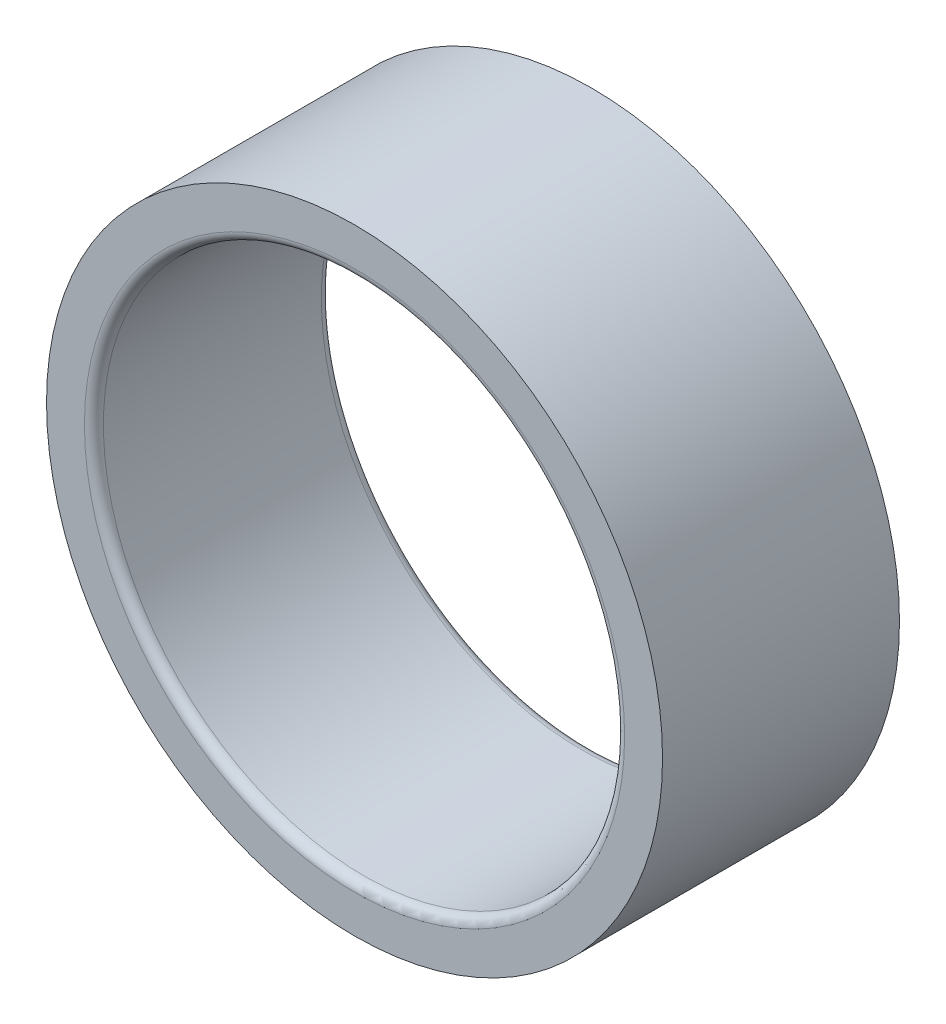
ISO-10303-21;
HEADER;
FILE_DESCRIPTION(('STEP AP214'),'2;1');
FILE_NAME('part.step','',(''),(''),'','','');
FILE_SCHEMA(('AUTOMOTIVE_DESIGN { 1 0 10303 214 1 1 1 1 }'));
ENDSEC;
DATA;
#1=APPLICATION_CONTEXT('core data for automotive mechanical design processes');
#2=APPLICATION_PROTOCOL_DEFINITION('international standard','automotive_design',2000,#1);
#3=PRODUCT_CONTEXT('',#1,'mechanical');
#4=PRODUCT('Part','Part','',(#3));
#5=PRODUCT_RELATED_PRODUCT_CATEGORY('part','',(#4));
#6=PRODUCT_DEFINITION_FORMATION('','',#4);
#7=PRODUCT_DEFINITION_CONTEXT('part definition',#1,'design');
#8=PRODUCT_DEFINITION('design','',#6,#7);
#9=PRODUCT_DEFINITION_SHAPE('','',#8);
#10=(LENGTH_UNIT() NAMED_UNIT(*) SI_UNIT(.MILLI.,.METRE.));
#11=(NAMED_UNIT(*) PLANE_ANGLE_UNIT() SI_UNIT($,.RADIAN.));
#12=(NAMED_UNIT(*) SI_UNIT($,.STERADIAN.) SOLID_ANGLE_UNIT());
#13=UNCERTAINTY_MEASURE_WITH_UNIT(LENGTH_MEASURE(1.E-05),#10,'distance_accuracy_value','');
#14=(GEOMETRIC_REPRESENTATION_CONTEXT(3) GLOBAL_UNCERTAINTY_ASSIGNED_CONTEXT((#13)) GLOBAL_UNIT_ASSIGNED_CONTEXT((#10,
#11,#12)) REPRESENTATION_CONTEXT('',''));
#15=CARTESIAN_POINT('',(0.,0.,0.));
#16=DIRECTION('',(0.,0.,1.));
#17=DIRECTION('',(1.,0.,0.));
#18=AXIS2_PLACEMENT_3D('',#15,#16,#17);
#19=CARTESIAN_POINT('',(0.,0.,50.));
#20=DIRECTION('',(0.,0.,-1.));
#21=DIRECTION('',(-1.,0.,0.));
#22=AXIS2_PLACEMENT_3D('',#19,#20,#21);
#23=CYLINDRICAL_SURFACE('',#22,65.);
#24=CARTESIAN_POINT('',(0.,0.,50.));
#25=DIRECTION('',(0.,0.,1.));
#26=DIRECTION('',(1.,0.,0.));
#27=AXIS2_PLACEMENT_3D('',#24,#25,#26);
#28=CIRCLE('',#27,65.);
#29=CARTESIAN_POINT('',(65.,0.,50.));
#30=VERTEX_POINT('',#29);
#31=EDGE_CURVE('E50',#30,#30,#28,.T.);
#32=ORIENTED_EDGE('',*,*,#31,.F.);
#33=EDGE_LOOP('',(#32));
#34=FACE_BOUND('',#33,.T.);
#35=CARTESIAN_POINT('',(0.,0.,0.));
#36=DIRECTION('',(0.,0.,1.));
#37=DIRECTION('',(1.,0.,0.));
#38=AXIS2_PLACEMENT_3D('',#35,#36,#37);
#39=CIRCLE('',#38,65.);
#40=CARTESIAN_POINT('',(65.,0.,0.));
#41=VERTEX_POINT('',#40);
#42=EDGE_CURVE('E51',#41,#41,#39,.T.);
#43=ORIENTED_EDGE('',*,*,#42,.T.);
#44=EDGE_LOOP('',(#43));
#45=FACE_BOUND('',#44,.T.);
#46=ADVANCED_FACE('F30',(#34,#45),#23,.T.);
#47=CARTESIAN_POINT('',(0.,0.,50.));
#48=DIRECTION('',(0.,0.,1.));
#49=DIRECTION('',(1.,0.,0.));
#50=AXIS2_PLACEMENT_3D('',#47,#48,#49);
#51=PLANE('',#50);
#52=CARTESIAN_POINT('',(0.,0.,50.));
#53=DIRECTION('',(0.,0.,1.));
#54=DIRECTION('',(1.,0.,0.));
#55=AXIS2_PLACEMENT_3D('',#52,#53,#54);
#56=CIRCLE('',#55,57.);
#57=CARTESIAN_POINT('',(57.,0.,50.));
#58=VERTEX_POINT('',#57);
#59=EDGE_CURVE('E10',#58,#58,#56,.F.);
#60=ORIENTED_EDGE('',*,*,#59,.T.);
#61=EDGE_LOOP('',(#60));
#62=FACE_BOUND('',#61,.T.);
#63=ORIENTED_EDGE('',*,*,#31,.T.);
#64=EDGE_LOOP('',(#63));
#65=FACE_BOUND('',#64,.T.);
#66=ADVANCED_FACE('F57',(#62,#65),#51,.T.);
#67=CARTESIAN_POINT('',(0.,0.,0.));
#68=DIRECTION('',(0.,0.,1.));
#69=DIRECTION('',(1.,0.,0.));
#70=AXIS2_PLACEMENT_3D('',#67,#68,#69);
#71=PLANE('',#70);
#72=CARTESIAN_POINT('',(0.,0.,0.));
#73=DIRECTION('',(0.,0.,1.));
#74=DIRECTION('',(1.,0.,0.));
#75=AXIS2_PLACEMENT_3D('',#72,#73,#74);
#76=CIRCLE('',#75,57.);
#77=CARTESIAN_POINT('',(57.,0.,0.));
#78=VERTEX_POINT('',#77);
#79=EDGE_CURVE('E45',#78,#78,#76,.T.);
#80=ORIENTED_EDGE('',*,*,#79,.T.);
#81=EDGE_LOOP('',(#80));
#82=FACE_BOUND('',#81,.T.);
#83=ORIENTED_EDGE('',*,*,#42,.F.);
#84=EDGE_LOOP('',(#83));
#85=FACE_BOUND('',#84,.T.);
#86=ADVANCED_FACE('F64',(#82,#85),#71,.F.);
#87=CARTESIAN_POINT('',(0.,0.,0.));
#88=DIRECTION('',(0.,0.,1.));
#89=DIRECTION('',(1.,0.,0.));
#90=AXIS2_PLACEMENT_3D('',#87,#88,#89);
#91=CYLINDRICAL_SURFACE('',#90,55.);
#92=CARTESIAN_POINT('',(0.,0.,2.));
#93=DIRECTION('',(0.,0.,1.));
#94=DIRECTION('',(1.,0.,0.));
#95=AXIS2_PLACEMENT_3D('',#92,#93,#94);
#96=CIRCLE('',#95,55.);
#97=CARTESIAN_POINT('',(55.,0.,2.));
#98=VERTEX_POINT('',#97);
#99=EDGE_CURVE('E37',#98,#98,#96,.F.);
#100=ORIENTED_EDGE('',*,*,#99,.T.);
#101=EDGE_LOOP('',(#100));
#102=FACE_BOUND('',#101,.T.);
#103=CARTESIAN_POINT('',(0.,0.,48.));
#104=DIRECTION('',(0.,0.,1.));
#105=DIRECTION('',(1.,0.,0.));
#106=AXIS2_PLACEMENT_3D('',#103,#104,#105);
#107=CIRCLE('',#106,55.);
#108=CARTESIAN_POINT('',(55.,0.,48.));
#109=VERTEX_POINT('',#108);
#110=EDGE_CURVE('E41',#109,#109,#107,.T.);
#111=ORIENTED_EDGE('',*,*,#110,.T.);
#112=EDGE_LOOP('',(#111));
#113=FACE_BOUND('',#112,.T.);
#114=ADVANCED_FACE('F66',(#102,#113),#91,.F.);
#115=CARTESIAN_POINT('',(0.,0.,2.));
#116=DIRECTION('',(0.,0.,1.));
#117=DIRECTION('',(1.,0.,0.));
#118=AXIS2_PLACEMENT_3D('',#115,#116,#117);
#119=TOROIDAL_SURFACE('',#118,57.,2.);
#120=ORIENTED_EDGE('',*,*,#99,.F.);
#121=EDGE_LOOP('',(#120));
#122=FACE_BOUND('',#121,.T.);
#123=ORIENTED_EDGE('',*,*,#79,.F.);
#124=EDGE_LOOP('',(#123));
#125=FACE_BOUND('',#124,.T.);
#126=ADVANCED_FACE('F73',(#122,#125),#119,.T.);
#127=CARTESIAN_POINT('',(0.,0.,48.));
#128=DIRECTION('',(0.,0.,1.));
#129=DIRECTION('',(1.,0.,0.));
#130=AXIS2_PLACEMENT_3D('',#127,#128,#129);
#131=TOROIDAL_SURFACE('',#130,57.,2.);
#132=ORIENTED_EDGE('',*,*,#59,.F.);
#133=EDGE_LOOP('',(#132));
#134=FACE_BOUND('',#133,.T.);
#135=ORIENTED_EDGE('',*,*,#110,.F.);
#136=EDGE_LOOP('',(#135));
#137=FACE_BOUND('',#136,.T.);
#138=ADVANCED_FACE('F32',(#134,#137),#131,.T.);
#139=CLOSED_SHELL('',(#46,#66,#86,#114,#126,#138));
#140=MANIFOLD_SOLID_BREP('B2',#139);
#141=ADVANCED_BREP_SHAPE_REPRESENTATION('',(#18,#140),#14);
#142=SHAPE_DEFINITION_REPRESENTATION(#9,#141);
ENDSEC;
END-ISO-10303-21;
